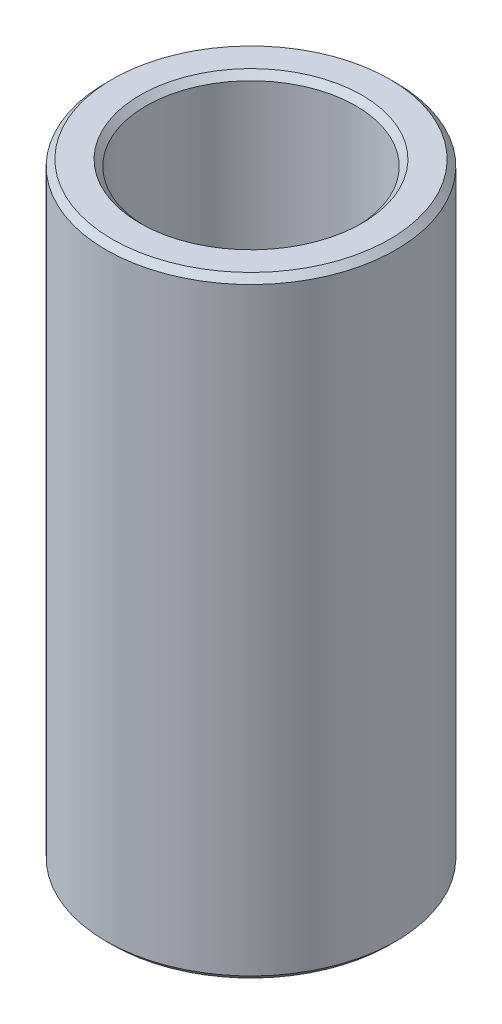
ISO-10303-21;
HEADER;
FILE_DESCRIPTION(('STEP AP214'),'2;1');
FILE_NAME('part.step','',(''),(''),'','','');
FILE_SCHEMA(('AUTOMOTIVE_DESIGN { 1 0 10303 214 1 1 1 1 }'));
ENDSEC;
DATA;
#1=APPLICATION_CONTEXT('core data for automotive mechanical design processes');
#2=APPLICATION_PROTOCOL_DEFINITION('international standard','automotive_design',2000,#1);
#3=PRODUCT_CONTEXT('',#1,'mechanical');
#4=PRODUCT('Part','Part','',(#3));
#5=PRODUCT_RELATED_PRODUCT_CATEGORY('part','',(#4));
#6=PRODUCT_DEFINITION_FORMATION('','',#4);
#7=PRODUCT_DEFINITION_CONTEXT('part definition',#1,'design');
#8=PRODUCT_DEFINITION('design','',#6,#7);
#9=PRODUCT_DEFINITION_SHAPE('','',#8);
#10=(LENGTH_UNIT() NAMED_UNIT(*) SI_UNIT(.MILLI.,.METRE.));
#11=(NAMED_UNIT(*) PLANE_ANGLE_UNIT() SI_UNIT($,.RADIAN.));
#12=(NAMED_UNIT(*) SI_UNIT($,.STERADIAN.) SOLID_ANGLE_UNIT());
#13=UNCERTAINTY_MEASURE_WITH_UNIT(LENGTH_MEASURE(1.E-05),#10,'distance_accuracy_value','');
#14=(GEOMETRIC_REPRESENTATION_CONTEXT(3) GLOBAL_UNCERTAINTY_ASSIGNED_CONTEXT((#13)) GLOBAL_UNIT_ASSIGNED_CONTEXT((#10,
#11,#12)) REPRESENTATION_CONTEXT('',''));
#15=CARTESIAN_POINT('',(0.,0.,0.));
#16=DIRECTION('',(0.,0.,1.));
#17=DIRECTION('',(1.,0.,0.));
#18=AXIS2_PLACEMENT_3D('',#15,#16,#17);
#19=CARTESIAN_POINT('',(0.,179.309735716812,0.));
#20=DIRECTION('',(0.,-1.,0.));
#21=DIRECTION('',(0.,0.,-1.));
#22=AXIS2_PLACEMENT_3D('',#19,#20,#21);
#23=CYLINDRICAL_SURFACE('',#22,42.5);
#24=CARTESIAN_POINT('',(0.,1.80533685632936,0.));
#25=DIRECTION('',(0.,1.,0.));
#26=DIRECTION('',(0.,0.,1.));
#27=AXIS2_PLACEMENT_3D('',#24,#25,#26);
#28=CIRCLE('',#27,42.5);
#29=CARTESIAN_POINT('',(0.,1.80533685632936,-42.5));
#30=VERTEX_POINT('',#29);
#31=EDGE_CURVE('E10',#30,#30,#28,.T.);
#32=CARTESIAN_POINT('',(0.,177.504398860483,0.));
#33=DIRECTION('',(0.,1.,0.));
#34=DIRECTION('',(0.,0.,1.));
#35=AXIS2_PLACEMENT_3D('',#32,#33,#34);
#36=CIRCLE('',#35,42.5);
#37=CARTESIAN_POINT('',(0.,177.504398860483,-42.5));
#38=VERTEX_POINT('',#37);
#39=EDGE_CURVE('E50',#38,#38,#36,.F.);
#40=CARTESIAN_POINT('',(0.,1.80533685632936,-42.5));
#41=CARTESIAN_POINT('',(0.,3.63553541887263,-42.5));
#42=CARTESIAN_POINT('',(0.,5.46573398141589,-42.5));
#43=CARTESIAN_POINT('',(0.,9.12613110650242,-42.5));
#44=CARTESIAN_POINT('',(0.,10.9563296690457,-42.5));
#45=CARTESIAN_POINT('',(0.,14.6167267941322,-42.5));
#46=CARTESIAN_POINT('',(0.,16.4469253566755,-42.5));
#47=CARTESIAN_POINT('',(0.,20.107322481762,-42.5));
#48=CARTESIAN_POINT('',(0.,21.9375210443053,-42.5));
#49=CARTESIAN_POINT('',(0.,25.5979181693918,-42.5));
#50=CARTESIAN_POINT('',(0.,27.428116731935,-42.5));
#51=CARTESIAN_POINT('',(0.,31.0885138570216,-42.5));
#52=CARTESIAN_POINT('',(0.,32.9187124195648,-42.5));
#53=CARTESIAN_POINT('',(0.,36.5791095446514,-42.5));
#54=CARTESIAN_POINT('',(0.,38.4093081071946,-42.5));
#55=CARTESIAN_POINT('',(0.,42.0697052322812,-42.5));
#56=CARTESIAN_POINT('',(0.,43.8999037948244,-42.5));
#57=CARTESIAN_POINT('',(0.,47.5603009199109,-42.5));
#58=CARTESIAN_POINT('',(0.,49.3904994824542,-42.5));
#59=CARTESIAN_POINT('',(0.,53.0508966075407,-42.5));
#60=CARTESIAN_POINT('',(0.,54.881095170084,-42.5));
#61=CARTESIAN_POINT('',(0.,58.5414922951705,-42.5));
#62=CARTESIAN_POINT('',(0.,60.3716908577138,-42.5));
#63=CARTESIAN_POINT('',(0.,64.0320879828003,-42.5));
#64=CARTESIAN_POINT('',(0.,65.8622865453436,-42.5));
#65=CARTESIAN_POINT('',(0.,69.5226836704301,-42.5));
#66=CARTESIAN_POINT('',(0.,71.3528822329733,-42.5));
#67=CARTESIAN_POINT('',(0.,75.0132793580599,-42.5));
#68=CARTESIAN_POINT('',(0.,76.8434779206031,-42.5));
#69=CARTESIAN_POINT('',(0.,80.5038750456897,-42.5));
#70=CARTESIAN_POINT('',(0.,82.3340736082329,-42.5));
#71=CARTESIAN_POINT('',(0.,85.9944707333195,-42.5));
#72=CARTESIAN_POINT('',(0.,87.8246692958627,-42.5));
#73=CARTESIAN_POINT('',(0.,91.4850664209493,-42.5));
#74=CARTESIAN_POINT('',(0.,93.3152649834925,-42.5));
#75=CARTESIAN_POINT('',(0.,96.975662108579,-42.5));
#76=CARTESIAN_POINT('',(0.,98.8058606711223,-42.5));
#77=CARTESIAN_POINT('',(0.,102.466257796209,-42.5));
#78=CARTESIAN_POINT('',(0.,104.296456358752,-42.5));
#79=CARTESIAN_POINT('',(0.,107.956853483839,-42.5));
#80=CARTESIAN_POINT('',(0.,109.787052046382,-42.5));
#81=CARTESIAN_POINT('',(0.,113.447449171468,-42.5));
#82=CARTESIAN_POINT('',(0.,115.277647734012,-42.5));
#83=CARTESIAN_POINT('',(0.,118.938044859098,-42.5));
#84=CARTESIAN_POINT('',(0.,120.768243421641,-42.5));
#85=CARTESIAN_POINT('',(0.,124.428640546728,-42.5));
#86=CARTESIAN_POINT('',(0.,126.258839109271,-42.5));
#87=CARTESIAN_POINT('',(0.,129.919236234358,-42.5));
#88=CARTESIAN_POINT('',(0.,131.749434796901,-42.5));
#89=CARTESIAN_POINT('',(0.,135.409831921988,-42.5));
#90=CARTESIAN_POINT('',(0.,137.240030484531,-42.5));
#91=CARTESIAN_POINT('',(0.,140.900427609617,-42.5));
#92=CARTESIAN_POINT('',(0.,142.730626172161,-42.5));
#93=CARTESIAN_POINT('',(0.,146.391023297247,-42.5));
#94=CARTESIAN_POINT('',(0.,148.22122185979,-42.5));
#95=CARTESIAN_POINT('',(0.,151.881618984877,-42.5));
#96=CARTESIAN_POINT('',(0.,153.71181754742,-42.5));
#97=CARTESIAN_POINT('',(0.,157.372214672507,-42.5));
#98=CARTESIAN_POINT('',(0.,159.20241323505,-42.5));
#99=CARTESIAN_POINT('',(0.,162.862810360137,-42.5));
#100=CARTESIAN_POINT('',(0.,164.69300892268,-42.5));
#101=CARTESIAN_POINT('',(0.,168.353406047766,-42.5));
#102=CARTESIAN_POINT('',(0.,170.18360461031,-42.5));
#103=CARTESIAN_POINT('',(0.,173.844001735396,-42.5));
#104=CARTESIAN_POINT('',(0.,175.674200297939,-42.5));
#105=CARTESIAN_POINT('',(0.,177.504398860483,-42.5));
#106=B_SPLINE_CURVE_WITH_KNOTS('',3,(#40,#41,#42,#43,#44,#45,#46,#47,#48,#49,#50,#51,#52,#53,
#54,#55,#56,#57,#58,#59,#60,#61,#62,#63,#64,#65,#66,#67,#68,#69,#70,#71,#72,#73,#74,#75,#76,#77,
#78,#79,#80,#81,#82,#83,#84,#85,#86,#87,#88,#89,#90,#91,#92,#93,#94,#95,#96,#97,#98,#99,#100,
#101,#102,#103,#104,#105),.UNSPECIFIED.,.F.,.F.,(4,2,2,2,2,2,2,2,2,2,2,2,2,2,2,2,2,2,2,2,2,2,2,
2,2,2,2,2,2,2,2,2,4),(0.,5.4905956876298,10.9811913752596,16.4717870628894,21.9623827505192,
27.4529784381489,32.9435741257788,38.4341698134085,43.9247655010383,49.4153611886681,
54.9059568762979,60.3965525639277,65.8871482515575,71.3777439391873,76.868339626817,
82.3589353144468,87.8495310020766,93.3401266897064,98.8307223773362,104.321318064966,
109.811913752596,115.302509440226,120.793105127855,126.283700815485,131.774296503115,
137.264892190745,142.755487878375,148.246083566004,153.736679253634,159.227274941264,
164.717870628894,170.208466316523,175.699062004153),.UNSPECIFIED.);
#107=EDGE_CURVE('BSEAM39',#30,#38,#106,.T.);
#108=ORIENTED_EDGE('',*,*,#31,.T.);
#109=ORIENTED_EDGE('',*,*,#39,.T.);
#110=ORIENTED_EDGE('',*,*,#107,.T.);
#111=ORIENTED_EDGE('',*,*,#107,.F.);
#112=EDGE_LOOP('',(#108,#110,#109,#111));
#113=FACE_BOUND('',#112,.T.);
#114=ADVANCED_FACE('F39',(#113),#23,.T.);
#115=CARTESIAN_POINT('',(0.,179.309735716812,0.));
#116=DIRECTION('',(0.,1.,0.));
#117=DIRECTION('',(0.,0.,1.));
#118=AXIS2_PLACEMENT_3D('',#115,#116,#117);
#119=PLANE('',#118);
#120=CARTESIAN_POINT('',(0.,179.309735716812,0.));
#121=DIRECTION('',(0.,1.,0.));
#122=DIRECTION('',(0.,0.,1.));
#123=AXIS2_PLACEMENT_3D('',#120,#121,#122);
#124=CIRCLE('',#123,32.569115791011);
#125=CARTESIAN_POINT('',(0.,179.309735716812,32.569115791011));
#126=VERTEX_POINT('',#125);
#127=EDGE_CURVE('E58',#126,#126,#124,.F.);
#128=ORIENTED_EDGE('',*,*,#127,.T.);
#129=EDGE_LOOP('',(#128));
#130=FACE_BOUND('',#129,.T.);
#131=CARTESIAN_POINT('',(0.,179.309735716812,0.));
#132=DIRECTION('',(0.,1.,0.));
#133=DIRECTION('',(0.,0.,1.));
#134=AXIS2_PLACEMENT_3D('',#131,#132,#133);
#135=CIRCLE('',#134,40.6946631436709);
#136=CARTESIAN_POINT('',(0.,179.309735716812,40.6946631436709));
#137=VERTEX_POINT('',#136);
#138=EDGE_CURVE('E61',#137,#137,#135,.T.);
#139=ORIENTED_EDGE('',*,*,#138,.T.);
#140=EDGE_LOOP('',(#139));
#141=FACE_BOUND('',#140,.T.);
#142=ADVANCED_FACE('F88',(#130,#141),#119,.T.);
#143=CARTESIAN_POINT('',(0.,0.,0.));
#144=DIRECTION('',(0.,1.,0.));
#145=DIRECTION('',(0.,0.,1.));
#146=AXIS2_PLACEMENT_3D('',#143,#144,#145);
#147=PLANE('',#146);
#148=CARTESIAN_POINT('',(0.,0.,0.));
#149=DIRECTION('',(0.,1.,0.));
#150=DIRECTION('',(0.,0.,1.));
#151=AXIS2_PLACEMENT_3D('',#148,#149,#150);
#152=CIRCLE('',#151,32.5691157910109);
#153=CARTESIAN_POINT('',(0.,0.,32.5691157910109));
#154=VERTEX_POINT('',#153);
#155=EDGE_CURVE('E51',#154,#154,#152,.T.);
#156=ORIENTED_EDGE('',*,*,#155,.T.);
#157=EDGE_LOOP('',(#156));
#158=FACE_BOUND('',#157,.T.);
#159=CARTESIAN_POINT('',(0.,0.,0.));
#160=DIRECTION('',(0.,1.,0.));
#161=DIRECTION('',(0.,0.,1.));
#162=AXIS2_PLACEMENT_3D('',#159,#160,#161);
#163=CIRCLE('',#162,40.6946631436706);
#164=CARTESIAN_POINT('',(0.,0.,40.6946631436706));
#165=VERTEX_POINT('',#164);
#166=EDGE_CURVE('E54',#165,#165,#163,.F.);
#167=ORIENTED_EDGE('',*,*,#166,.T.);
#168=EDGE_LOOP('',(#167));
#169=FACE_BOUND('',#168,.T.);
#170=ADVANCED_FACE('F83',(#158,#169),#147,.F.);
#171=CARTESIAN_POINT('',(0.,179.309735716812,0.));
#172=DIRECTION('',(0.,-1.,0.));
#173=DIRECTION('',(0.,0.,-1.));
#174=AXIS2_PLACEMENT_3D('',#171,#172,#173);
#175=CYLINDRICAL_SURFACE('',#174,30.7637789346817);
#176=CARTESIAN_POINT('',(0.,177.504398860482,0.));
#177=DIRECTION('',(0.,1.,0.));
#178=DIRECTION('',(0.,0.,1.));
#179=AXIS2_PLACEMENT_3D('',#176,#177,#178);
#180=CIRCLE('',#179,30.7637789346817);
#181=CARTESIAN_POINT('',(0.,177.504398860482,-30.7637789346817));
#182=VERTEX_POINT('',#181);
#183=EDGE_CURVE('E67',#182,#182,#180,.T.);
#184=CARTESIAN_POINT('',(0.,1.80533685632916,0.));
#185=DIRECTION('',(0.,1.,0.));
#186=DIRECTION('',(0.,0.,1.));
#187=AXIS2_PLACEMENT_3D('',#184,#185,#186);
#188=CIRCLE('',#187,30.7637789346817);
#189=CARTESIAN_POINT('',(0.,1.80533685632914,-30.7637789346817));
#190=VERTEX_POINT('',#189);
#191=EDGE_CURVE('E69',#190,#190,#188,.F.);
#192=CARTESIAN_POINT('',(0.,177.504398860482,-30.7637789346817));
#193=CARTESIAN_POINT('',(0.,175.674200297939,-30.7637789346817));
#194=CARTESIAN_POINT('',(0.,173.844001735396,-30.7637789346817));
#195=CARTESIAN_POINT('',(0.,170.183604610309,-30.7637789346817));
#196=CARTESIAN_POINT('',(0.,168.353406047766,-30.7637789346817));
#197=CARTESIAN_POINT('',(0.,164.69300892268,-30.7637789346817));
#198=CARTESIAN_POINT('',(0.,162.862810360136,-30.7637789346817));
#199=CARTESIAN_POINT('',(0.,159.20241323505,-30.7637789346817));
#200=CARTESIAN_POINT('',(0.,157.372214672507,-30.7637789346817));
#201=CARTESIAN_POINT('',(0.,153.71181754742,-30.7637789346817));
#202=CARTESIAN_POINT('',(0.,151.881618984877,-30.7637789346817));
#203=CARTESIAN_POINT('',(0.,148.22122185979,-30.7637789346817));
#204=CARTESIAN_POINT('',(0.,146.391023297247,-30.7637789346817));
#205=CARTESIAN_POINT('',(0.,142.73062617216,-30.7637789346817));
#206=CARTESIAN_POINT('',(0.,140.900427609617,-30.7637789346817));
#207=CARTESIAN_POINT('',(0.,137.240030484531,-30.7637789346817));
#208=CARTESIAN_POINT('',(0.,135.409831921987,-30.7637789346817));
#209=CARTESIAN_POINT('',(0.,131.749434796901,-30.7637789346817));
#210=CARTESIAN_POINT('',(0.,129.919236234358,-30.7637789346817));
#211=CARTESIAN_POINT('',(0.,126.258839109271,-30.7637789346817));
#212=CARTESIAN_POINT('',(0.,124.428640546728,-30.7637789346817));
#213=CARTESIAN_POINT('',(0.,120.768243421641,-30.7637789346817));
#214=CARTESIAN_POINT('',(0.,118.938044859098,-30.7637789346817));
#215=CARTESIAN_POINT('',(0.,115.277647734011,-30.7637789346817));
#216=CARTESIAN_POINT('',(0.,113.447449171468,-30.7637789346817));
#217=CARTESIAN_POINT('',(0.,109.787052046382,-30.7637789346817));
#218=CARTESIAN_POINT('',(0.,107.956853483838,-30.7637789346817));
#219=CARTESIAN_POINT('',(0.,104.296456358752,-30.7637789346817));
#220=CARTESIAN_POINT('',(0.,102.466257796209,-30.7637789346817));
#221=CARTESIAN_POINT('',(0.,98.8058606711221,-30.7637789346817));
#222=CARTESIAN_POINT('',(0.,96.9756621085788,-30.7637789346817));
#223=CARTESIAN_POINT('',(0.,93.3152649834923,-30.7637789346817));
#224=CARTESIAN_POINT('',(0.,91.485066420949,-30.7637789346817));
#225=CARTESIAN_POINT('',(0.,87.8246692958625,-30.7637789346817));
#226=CARTESIAN_POINT('',(0.,85.9944707333193,-30.7637789346817));
#227=CARTESIAN_POINT('',(0.,82.3340736082327,-30.7637789346817));
#228=CARTESIAN_POINT('',(0.,80.5038750456895,-30.7637789346817));
#229=CARTESIAN_POINT('',(0.,76.8434779206029,-30.7637789346817));
#230=CARTESIAN_POINT('',(0.,75.0132793580597,-30.7637789346817));
#231=CARTESIAN_POINT('',(0.,71.3528822329731,-30.7637789346817));
#232=CARTESIAN_POINT('',(0.,69.5226836704299,-30.7637789346817));
#233=CARTESIAN_POINT('',(0.,65.8622865453434,-30.7637789346817));
#234=CARTESIAN_POINT('',(0.,64.0320879828001,-30.7637789346817));
#235=CARTESIAN_POINT('',(0.,60.3716908577136,-30.7637789346817));
#236=CARTESIAN_POINT('',(0.,58.5414922951703,-30.7637789346817));
#237=CARTESIAN_POINT('',(0.,54.8810951700838,-30.7637789346817));
#238=CARTESIAN_POINT('',(0.,53.0508966075405,-30.7637789346817));
#239=CARTESIAN_POINT('',(0.,49.390499482454,-30.7637789346817));
#240=CARTESIAN_POINT('',(0.,47.5603009199107,-30.7637789346817));
#241=CARTESIAN_POINT('',(0.,43.8999037948242,-30.7637789346817));
#242=CARTESIAN_POINT('',(0.,42.0697052322809,-30.7637789346817));
#243=CARTESIAN_POINT('',(0.,38.4093081071944,-30.7637789346817));
#244=CARTESIAN_POINT('',(0.,36.5791095446511,-30.7637789346817));
#245=CARTESIAN_POINT('',(0.,32.9187124195646,-30.7637789346817));
#246=CARTESIAN_POINT('',(0.,31.0885138570214,-30.7637789346817));
#247=CARTESIAN_POINT('',(0.,27.4281167319348,-30.7637789346817));
#248=CARTESIAN_POINT('',(0.,25.5979181693916,-30.7637789346817));
#249=CARTESIAN_POINT('',(0.,21.937521044305,-30.7637789346817));
#250=CARTESIAN_POINT('',(0.,20.1073224817618,-30.7637789346817));
#251=CARTESIAN_POINT('',(0.,16.4469253566752,-30.7637789346817));
#252=CARTESIAN_POINT('',(0.,14.616726794132,-30.7637789346817));
#253=CARTESIAN_POINT('',(0.,10.9563296690455,-30.7637789346817));
#254=CARTESIAN_POINT('',(0.,9.1261311065022,-30.7637789346817));
#255=CARTESIAN_POINT('',(0.,5.46573398141567,-30.7637789346817));
#256=CARTESIAN_POINT('',(0.,3.6355354188724,-30.7637789346817));
#257=CARTESIAN_POINT('',(0.,1.80533685632914,-30.7637789346817));
#258=B_SPLINE_CURVE_WITH_KNOTS('',3,(#192,#193,#194,#195,#196,#197,#198,#199,#200,#201,#202,
#203,#204,#205,#206,#207,#208,#209,#210,#211,#212,#213,#214,#215,#216,#217,#218,#219,#220,#221,
#222,#223,#224,#225,#226,#227,#228,#229,#230,#231,#232,#233,#234,#235,#236,#237,#238,#239,#240,
#241,#242,#243,#244,#245,#246,#247,#248,#249,#250,#251,#252,#253,#254,#255,#256,#257),
.UNSPECIFIED.,.F.,.F.,(4,2,2,2,2,2,2,2,2,2,2,2,2,2,2,2,2,2,2,2,2,2,2,2,2,2,2,2,2,2,2,2,4),(0.,
5.49059568762977,10.9811913752596,16.4717870628893,21.9623827505192,27.4529784381489,
32.9435741257787,38.4341698134085,43.9247655010383,49.4153611886681,54.9059568762979,
60.3965525639277,65.8871482515574,71.3777439391872,76.868339626817,82.3589353144468,
87.8495310020766,93.3401266897064,98.8307223773362,104.321318064966,109.811913752596,
115.302509440226,120.793105127855,126.283700815485,131.774296503115,137.264892190745,
142.755487878375,148.246083566004,153.736679253634,159.227274941264,164.717870628894,
170.208466316523,175.699062004153),.UNSPECIFIED.);
#259=EDGE_CURVE('BSEAM71',#182,#190,#258,.T.);
#260=ORIENTED_EDGE('',*,*,#183,.T.);
#261=ORIENTED_EDGE('',*,*,#191,.T.);
#262=ORIENTED_EDGE('',*,*,#259,.T.);
#263=ORIENTED_EDGE('',*,*,#259,.F.);
#264=EDGE_LOOP('',(#260,#262,#261,#263));
#265=FACE_BOUND('',#264,.T.);
#266=ADVANCED_FACE('F71',(#265),#175,.F.);
#267=CARTESIAN_POINT('',(0.,177.504398860482,0.));
#268=DIRECTION('',(0.,1.,0.));
#269=DIRECTION('',(0.,0.,1.));
#270=AXIS2_PLACEMENT_3D('',#267,#268,#269);
#271=CONICAL_SURFACE('',#270,30.7637789346817,0.785398163397444);
#272=ORIENTED_EDGE('',*,*,#127,.F.);
#273=EDGE_LOOP('',(#272));
#274=FACE_BOUND('',#273,.T.);
#275=ORIENTED_EDGE('',*,*,#183,.F.);
#276=EDGE_LOOP('',(#275));
#277=FACE_BOUND('',#276,.T.);
#278=ADVANCED_FACE('F77',(#274,#277),#271,.F.);
#279=CARTESIAN_POINT('',(0.,0.,0.));
#280=DIRECTION('',(0.,-1.,0.));
#281=DIRECTION('',(0.,0.,-1.));
#282=AXIS2_PLACEMENT_3D('',#279,#280,#281);
#283=CONICAL_SURFACE('',#282,32.5691157910109,0.785398163397449);
#284=ORIENTED_EDGE('',*,*,#191,.F.);
#285=EDGE_LOOP('',(#284));
#286=FACE_BOUND('',#285,.T.);
#287=ORIENTED_EDGE('',*,*,#155,.F.);
#288=EDGE_LOOP('',(#287));
#289=FACE_BOUND('',#288,.T.);
#290=ADVANCED_FACE('F73',(#286,#289),#283,.F.);
#291=CARTESIAN_POINT('',(0.,1.80533685632936,0.));
#292=DIRECTION('',(0.,1.,0.));
#293=DIRECTION('',(0.,0.,1.));
#294=AXIS2_PLACEMENT_3D('',#291,#292,#293);
#295=CONICAL_SURFACE('',#294,42.5,0.78539816339745);
#296=ORIENTED_EDGE('',*,*,#166,.F.);
#297=EDGE_LOOP('',(#296));
#298=FACE_BOUND('',#297,.T.);
#299=ORIENTED_EDGE('',*,*,#31,.F.);
#300=EDGE_LOOP('',(#299));
#301=FACE_BOUND('',#300,.T.);
#302=ADVANCED_FACE('F76',(#298,#301),#295,.T.);
#303=CARTESIAN_POINT('',(0.,179.309735716812,0.));
#304=DIRECTION('',(0.,-1.,0.));
#305=DIRECTION('',(0.,0.,-1.));
#306=AXIS2_PLACEMENT_3D('',#303,#304,#305);
#307=CONICAL_SURFACE('',#306,40.6946631436709,0.785398163397443);
#308=ORIENTED_EDGE('',*,*,#39,.F.);
#309=EDGE_LOOP('',(#308));
#310=FACE_BOUND('',#309,.T.);
#311=ORIENTED_EDGE('',*,*,#138,.F.);
#312=EDGE_LOOP('',(#311));
#313=FACE_BOUND('',#312,.T.);
#314=ADVANCED_FACE('F45',(#310,#313),#307,.T.);
#315=CLOSED_SHELL('',(#114,#142,#170,#266,#278,#290,#302,#314));
#316=MANIFOLD_SOLID_BREP('B2',#315);
#317=ADVANCED_BREP_SHAPE_REPRESENTATION('',(#18,#316),#14);
#318=SHAPE_DEFINITION_REPRESENTATION(#9,#317);
ENDSEC;
END-ISO-10303-21;
